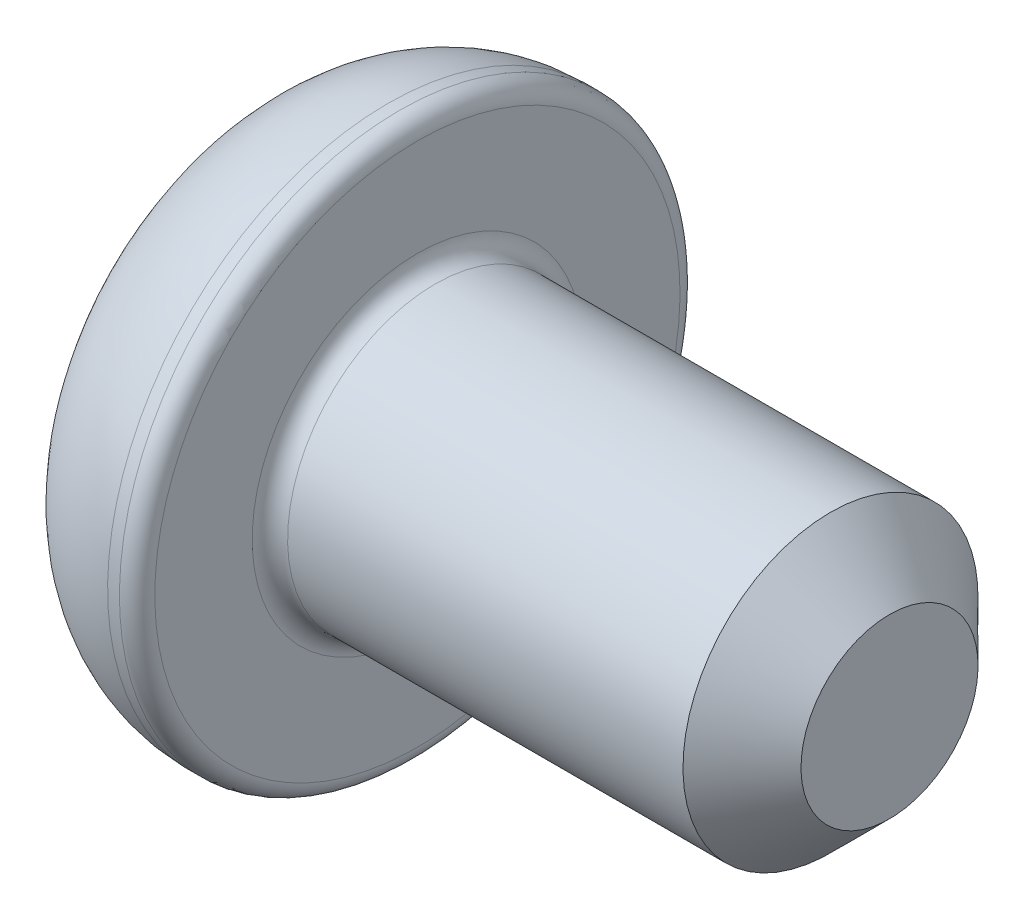
ISO-10303-21;
HEADER;
FILE_DESCRIPTION(('STEP AP214'),'2;1');
FILE_NAME('part.step','',(''),(''),'','','');
FILE_SCHEMA(('AUTOMOTIVE_DESIGN { 1 0 10303 214 1 1 1 1 }'));
ENDSEC;
DATA;
#1=APPLICATION_CONTEXT('core data for automotive mechanical design processes');
#2=APPLICATION_PROTOCOL_DEFINITION('international standard','automotive_design',2000,#1);
#3=PRODUCT_CONTEXT('',#1,'mechanical');
#4=PRODUCT('Part','Part','',(#3));
#5=PRODUCT_RELATED_PRODUCT_CATEGORY('part','',(#4));
#6=PRODUCT_DEFINITION_FORMATION('','',#4);
#7=PRODUCT_DEFINITION_CONTEXT('part definition',#1,'design');
#8=PRODUCT_DEFINITION('design','',#6,#7);
#9=PRODUCT_DEFINITION_SHAPE('','',#8);
#10=(LENGTH_UNIT() NAMED_UNIT(*) SI_UNIT(.MILLI.,.METRE.));
#11=(NAMED_UNIT(*) PLANE_ANGLE_UNIT() SI_UNIT($,.RADIAN.));
#12=(NAMED_UNIT(*) SI_UNIT($,.STERADIAN.) SOLID_ANGLE_UNIT());
#13=UNCERTAINTY_MEASURE_WITH_UNIT(LENGTH_MEASURE(1.E-05),#10,'distance_accuracy_value','');
#14=(GEOMETRIC_REPRESENTATION_CONTEXT(3) GLOBAL_UNCERTAINTY_ASSIGNED_CONTEXT((#13)) GLOBAL_UNIT_ASSIGNED_CONTEXT((#10,
#11,#12)) REPRESENTATION_CONTEXT('',''));
#15=CARTESIAN_POINT('',(0.,0.,0.));
#16=DIRECTION('',(0.,0.,1.));
#17=DIRECTION('',(1.,0.,0.));
#18=AXIS2_PLACEMENT_3D('',#15,#16,#17);
#19=CARTESIAN_POINT('',(0.,0.,0.));
#20=DIRECTION('',(-1.,0.,0.));
#21=DIRECTION('',(0.,-1.,0.));
#22=AXIS2_PLACEMENT_3D('',#19,#20,#21);
#23=PLANE('',#22);
#24=DIRECTION('',(0.,0.866025403784438,-0.5));
#25=VECTOR('',#24,1.);
#26=CARTESIAN_POINT('',(0.,0.,1.73205080756888));
#27=LINE('',#26,#25);
#28=CARTESIAN_POINT('',(0.,0.,1.73205080756888));
#29=VERTEX_POINT('',#28);
#30=CARTESIAN_POINT('',(0.,1.5,0.866025403784438));
#31=VERTEX_POINT('',#30);
#32=EDGE_CURVE('E53',#29,#31,#27,.T.);
#33=ORIENTED_EDGE('',*,*,#32,.F.);
#34=DIRECTION('',(0.,0.866025403784439,0.5));
#35=VECTOR('',#34,1.);
#36=CARTESIAN_POINT('',(0.,-1.5,0.866025403784438));
#37=LINE('',#36,#35);
#38=CARTESIAN_POINT('',(0.,-1.5,0.866025403784438));
#39=VERTEX_POINT('',#38);
#40=EDGE_CURVE('E136',#39,#29,#37,.T.);
#41=ORIENTED_EDGE('',*,*,#40,.F.);
#42=DIRECTION('',(0.,0.,1.));
#43=VECTOR('',#42,1.);
#44=CARTESIAN_POINT('',(0.,-1.5,-0.866025403784439));
#45=LINE('',#44,#43);
#46=CARTESIAN_POINT('',(0.,-1.5,-0.866025403784439));
#47=VERTEX_POINT('',#46);
#48=EDGE_CURVE('E134',#47,#39,#45,.T.);
#49=ORIENTED_EDGE('',*,*,#48,.F.);
#50=DIRECTION('',(0.,-0.866025403784438,0.5));
#51=VECTOR('',#50,1.);
#52=CARTESIAN_POINT('',(0.,0.,-1.73205080756888));
#53=LINE('',#52,#51);
#54=CARTESIAN_POINT('',(0.,0.,-1.73205080756888));
#55=VERTEX_POINT('',#54);
#56=EDGE_CURVE('E101',#55,#47,#53,.T.);
#57=ORIENTED_EDGE('',*,*,#56,.F.);
#58=DIRECTION('',(0.,-0.866025403784439,-0.5));
#59=VECTOR('',#58,1.);
#60=CARTESIAN_POINT('',(0.,1.5,-0.866025403784439));
#61=LINE('',#60,#59);
#62=CARTESIAN_POINT('',(0.,1.5,-0.866025403784439));
#63=VERTEX_POINT('',#62);
#64=EDGE_CURVE('E130',#63,#55,#61,.T.);
#65=ORIENTED_EDGE('',*,*,#64,.F.);
#66=DIRECTION('',(0.,0.,-1.));
#67=VECTOR('',#66,1.);
#68=CARTESIAN_POINT('',(0.,1.5,0.866025403784438));
#69=LINE('',#68,#67);
#70=EDGE_CURVE('E127',#31,#63,#69,.T.);
#71=ORIENTED_EDGE('',*,*,#70,.F.);
#72=EDGE_LOOP('',(#33,#41,#49,#57,#65,#71));
#73=FACE_BOUND('',#72,.T.);
#74=CARTESIAN_POINT('',(0.,0.,0.));
#75=DIRECTION('',(1.,0.,0.));
#76=DIRECTION('',(0.,1.,0.));
#77=AXIS2_PLACEMENT_3D('',#74,#75,#76);
#78=CIRCLE('',#77,3.625);
#79=CARTESIAN_POINT('',(0.,3.625,0.));
#80=VERTEX_POINT('',#79);
#81=EDGE_CURVE('E148',#80,#80,#78,.T.);
#82=ORIENTED_EDGE('',*,*,#81,.F.);
#83=EDGE_LOOP('',(#82));
#84=FACE_BOUND('',#83,.T.);
#85=ADVANCED_FACE('F37',(#73,#84),#23,.T.);
#86=CARTESIAN_POINT('',(2.1,0.,0.));
#87=DIRECTION('',(1.,0.,0.));
#88=DIRECTION('',(0.,1.,0.));
#89=AXIS2_PLACEMENT_3D('',#86,#87,#88);
#90=DEGENERATE_TOROIDAL_SURFACE('',#89,2.2275,2.5225,.T.);
#91=ORIENTED_EDGE('',*,*,#81,.T.);
#92=EDGE_LOOP('',(#91));
#93=FACE_BOUND('',#92,.T.);
#94=CARTESIAN_POINT('',(2.1,0.,0.));
#95=DIRECTION('',(1.,0.,0.));
#96=DIRECTION('',(0.,1.,0.));
#97=AXIS2_PLACEMENT_3D('',#94,#95,#96);
#98=CIRCLE('',#97,4.75);
#99=CARTESIAN_POINT('',(2.1,4.75,0.));
#100=VERTEX_POINT('',#99);
#101=EDGE_CURVE('E140',#100,#100,#98,.T.);
#102=ORIENTED_EDGE('',*,*,#101,.F.);
#103=EDGE_LOOP('',(#102));
#104=FACE_BOUND('',#103,.T.);
#105=ADVANCED_FACE('F177',(#93,#104),#90,.T.);
#106=CARTESIAN_POINT('',(10.6,0.,0.));
#107=DIRECTION('',(1.,0.,0.));
#108=DIRECTION('',(0.,1.,0.));
#109=AXIS2_PLACEMENT_3D('',#106,#107,#108);
#110=CYLINDRICAL_SURFACE('',#109,4.75);
#111=CARTESIAN_POINT('',(2.3,0.,0.));
#112=DIRECTION('',(1.,0.,0.));
#113=DIRECTION('',(0.,1.,0.));
#114=AXIS2_PLACEMENT_3D('',#111,#112,#113);
#115=CIRCLE('',#114,4.75);
#116=CARTESIAN_POINT('',(2.3,4.75,0.));
#117=VERTEX_POINT('',#116);
#118=EDGE_CURVE('E160',#117,#117,#115,.F.);
#119=ORIENTED_EDGE('',*,*,#118,.T.);
#120=EDGE_LOOP('',(#119));
#121=FACE_BOUND('',#120,.T.);
#122=ORIENTED_EDGE('',*,*,#101,.T.);
#123=EDGE_LOOP('',(#122));
#124=FACE_BOUND('',#123,.T.);
#125=ADVANCED_FACE('F183',(#121,#124),#110,.T.);
#126=CARTESIAN_POINT('',(2.6,4.75,0.));
#127=DIRECTION('',(1.,0.,0.));
#128=DIRECTION('',(0.,1.,0.));
#129=AXIS2_PLACEMENT_3D('',#126,#127,#128);
#130=PLANE('',#129);
#131=CARTESIAN_POINT('',(2.6,0.,0.));
#132=DIRECTION('',(1.,0.,0.));
#133=DIRECTION('',(0.,1.,0.));
#134=AXIS2_PLACEMENT_3D('',#131,#132,#133);
#135=CIRCLE('',#134,2.8);
#136=CARTESIAN_POINT('',(2.6,2.8,0.));
#137=VERTEX_POINT('',#136);
#138=EDGE_CURVE('E157',#137,#137,#135,.F.);
#139=ORIENTED_EDGE('',*,*,#138,.T.);
#140=EDGE_LOOP('',(#139));
#141=FACE_BOUND('',#140,.T.);
#142=CARTESIAN_POINT('',(2.6,0.,0.));
#143=DIRECTION('',(1.,0.,0.));
#144=DIRECTION('',(0.,1.,0.));
#145=AXIS2_PLACEMENT_3D('',#142,#143,#144);
#146=CIRCLE('',#145,4.45);
#147=CARTESIAN_POINT('',(2.6,4.45,0.));
#148=VERTEX_POINT('',#147);
#149=EDGE_CURVE('E154',#148,#148,#146,.T.);
#150=ORIENTED_EDGE('',*,*,#149,.T.);
#151=EDGE_LOOP('',(#150));
#152=FACE_BOUND('',#151,.T.);
#153=ADVANCED_FACE('F202',(#141,#152),#130,.T.);
#154=CARTESIAN_POINT('',(10.6,0.,0.));
#155=DIRECTION('',(1.,0.,0.));
#156=DIRECTION('',(0.,1.,0.));
#157=AXIS2_PLACEMENT_3D('',#154,#155,#156);
#158=CYLINDRICAL_SURFACE('',#157,2.5);
#159=CARTESIAN_POINT('',(9.6,0.,0.));
#160=DIRECTION('',(1.,0.,0.));
#161=DIRECTION('',(0.,1.,0.));
#162=AXIS2_PLACEMENT_3D('',#159,#160,#161);
#163=CIRCLE('',#162,2.5);
#164=CARTESIAN_POINT('',(9.6,2.5,0.));
#165=VERTEX_POINT('',#164);
#166=EDGE_CURVE('E11',#165,#165,#163,.F.);
#167=ORIENTED_EDGE('',*,*,#166,.T.);
#168=EDGE_LOOP('',(#167));
#169=FACE_BOUND('',#168,.T.);
#170=CARTESIAN_POINT('',(2.9,0.,0.));
#171=DIRECTION('',(1.,0.,0.));
#172=DIRECTION('',(0.,1.,0.));
#173=AXIS2_PLACEMENT_3D('',#170,#171,#172);
#174=CIRCLE('',#173,2.5);
#175=CARTESIAN_POINT('',(2.9,2.5,0.));
#176=VERTEX_POINT('',#175);
#177=EDGE_CURVE('E151',#176,#176,#174,.T.);
#178=ORIENTED_EDGE('',*,*,#177,.T.);
#179=EDGE_LOOP('',(#178));
#180=FACE_BOUND('',#179,.T.);
#181=ADVANCED_FACE('F200',(#169,#180),#158,.T.);
#182=CARTESIAN_POINT('',(10.6,2.5,0.));
#183=DIRECTION('',(1.,0.,0.));
#184=DIRECTION('',(0.,1.,0.));
#185=AXIS2_PLACEMENT_3D('',#182,#183,#184);
#186=PLANE('',#185);
#187=CARTESIAN_POINT('',(10.6,0.,0.));
#188=DIRECTION('',(1.,0.,0.));
#189=DIRECTION('',(0.,1.,0.));
#190=AXIS2_PLACEMENT_3D('',#187,#188,#189);
#191=CIRCLE('',#190,1.50000000000001);
#192=CARTESIAN_POINT('',(10.6,1.5,0.));
#193=VERTEX_POINT('',#192);
#194=EDGE_CURVE('E46',#193,#193,#191,.T.);
#195=ORIENTED_EDGE('',*,*,#194,.T.);
#196=EDGE_LOOP('',(#195));
#197=FACE_BOUND('',#196,.T.);
#198=ADVANCED_FACE('F165',(#197),#186,.T.);
#199=CARTESIAN_POINT('',(1.5,0.,1.73205080756888));
#200=DIRECTION('',(0.,0.5,0.866025403784439));
#201=DIRECTION('',(0.,-0.866025403784439,0.5));
#202=AXIS2_PLACEMENT_3D('',#199,#200,#201);
#203=PLANE('',#202);
#204=ORIENTED_EDGE('',*,*,#32,.T.);
#205=DIRECTION('',(-1.,0.,0.));
#206=VECTOR('',#205,1.);
#207=CARTESIAN_POINT('',(1.5,1.5,0.866025403784438));
#208=LINE('',#207,#206);
#209=CARTESIAN_POINT('',(1.5,1.5,0.866025403784438));
#210=VERTEX_POINT('',#209);
#211=EDGE_CURVE('E83',#210,#31,#208,.T.);
#212=ORIENTED_EDGE('',*,*,#211,.F.);
#213=DIRECTION('',(0.,0.866025403784438,-0.5));
#214=VECTOR('',#213,1.);
#215=CARTESIAN_POINT('',(1.5,0.,1.73205080756888));
#216=LINE('',#215,#214);
#217=CARTESIAN_POINT('',(1.5,0.,1.73205080756888));
#218=VERTEX_POINT('',#217);
#219=EDGE_CURVE('E138',#218,#210,#216,.T.);
#220=ORIENTED_EDGE('',*,*,#219,.F.);
#221=DIRECTION('',(-1.,0.,0.));
#222=VECTOR('',#221,1.);
#223=CARTESIAN_POINT('',(1.5,0.,1.73205080756888));
#224=LINE('',#223,#222);
#225=EDGE_CURVE('E61',#218,#29,#224,.T.);
#226=ORIENTED_EDGE('',*,*,#225,.T.);
#227=EDGE_LOOP('',(#204,#212,#220,#226));
#228=FACE_BOUND('',#227,.T.);
#229=ADVANCED_FACE('F209',(#228),#203,.F.);
#230=CARTESIAN_POINT('',(1.5,-1.5,0.866025403784438));
#231=DIRECTION('',(0.,-0.5,0.866025403784438));
#232=DIRECTION('',(0.,-0.866025403784439,-0.5));
#233=AXIS2_PLACEMENT_3D('',#230,#231,#232);
#234=PLANE('',#233);
#235=ORIENTED_EDGE('',*,*,#40,.T.);
#236=ORIENTED_EDGE('',*,*,#225,.F.);
#237=DIRECTION('',(0.,0.866025403784439,0.5));
#238=VECTOR('',#237,1.);
#239=CARTESIAN_POINT('',(1.5,-1.5,0.866025403784438));
#240=LINE('',#239,#238);
#241=CARTESIAN_POINT('',(1.5,-1.5,0.866025403784438));
#242=VERTEX_POINT('',#241);
#243=EDGE_CURVE('E113',#242,#218,#240,.T.);
#244=ORIENTED_EDGE('',*,*,#243,.F.);
#245=DIRECTION('',(-1.,0.,0.));
#246=VECTOR('',#245,1.);
#247=CARTESIAN_POINT('',(1.5,-1.5,0.866025403784438));
#248=LINE('',#247,#246);
#249=EDGE_CURVE('E105',#242,#39,#248,.T.);
#250=ORIENTED_EDGE('',*,*,#249,.T.);
#251=EDGE_LOOP('',(#235,#236,#244,#250));
#252=FACE_BOUND('',#251,.T.);
#253=ADVANCED_FACE('F266',(#252),#234,.F.);
#254=CARTESIAN_POINT('',(1.5,-1.5,-0.866025403784439));
#255=DIRECTION('',(0.,-1.,0.));
#256=DIRECTION('',(0.,0.,-1.));
#257=AXIS2_PLACEMENT_3D('',#254,#255,#256);
#258=PLANE('',#257);
#259=ORIENTED_EDGE('',*,*,#48,.T.);
#260=ORIENTED_EDGE('',*,*,#249,.F.);
#261=DIRECTION('',(0.,0.,1.));
#262=VECTOR('',#261,1.);
#263=CARTESIAN_POINT('',(1.5,-1.5,-0.866025403784439));
#264=LINE('',#263,#262);
#265=CARTESIAN_POINT('',(1.5,-1.5,-0.866025403784439));
#266=VERTEX_POINT('',#265);
#267=EDGE_CURVE('E109',#266,#242,#264,.T.);
#268=ORIENTED_EDGE('',*,*,#267,.F.);
#269=DIRECTION('',(-1.,0.,0.));
#270=VECTOR('',#269,1.);
#271=CARTESIAN_POINT('',(1.5,-1.5,-0.866025403784439));
#272=LINE('',#271,#270);
#273=EDGE_CURVE('E94',#266,#47,#272,.T.);
#274=ORIENTED_EDGE('',*,*,#273,.T.);
#275=EDGE_LOOP('',(#259,#260,#268,#274));
#276=FACE_BOUND('',#275,.T.);
#277=ADVANCED_FACE('F110',(#276),#258,.F.);
#278=CARTESIAN_POINT('',(1.5,0.,-1.73205080756888));
#279=DIRECTION('',(0.,-0.5,-0.866025403784439));
#280=DIRECTION('',(0.,0.866025403784439,-0.5));
#281=AXIS2_PLACEMENT_3D('',#278,#279,#280);
#282=PLANE('',#281);
#283=ORIENTED_EDGE('',*,*,#56,.T.);
#284=ORIENTED_EDGE('',*,*,#273,.F.);
#285=DIRECTION('',(0.,-0.866025403784438,0.5));
#286=VECTOR('',#285,1.);
#287=CARTESIAN_POINT('',(1.5,0.,-1.73205080756888));
#288=LINE('',#287,#286);
#289=CARTESIAN_POINT('',(1.5,0.,-1.73205080756888));
#290=VERTEX_POINT('',#289);
#291=EDGE_CURVE('E98',#290,#266,#288,.T.);
#292=ORIENTED_EDGE('',*,*,#291,.F.);
#293=DIRECTION('',(-1.,0.,0.));
#294=VECTOR('',#293,1.);
#295=CARTESIAN_POINT('',(1.5,0.,-1.73205080756888));
#296=LINE('',#295,#294);
#297=EDGE_CURVE('E106',#290,#55,#296,.T.);
#298=ORIENTED_EDGE('',*,*,#297,.T.);
#299=EDGE_LOOP('',(#283,#284,#292,#298));
#300=FACE_BOUND('',#299,.T.);
#301=ADVANCED_FACE('F96',(#300),#282,.F.);
#302=CARTESIAN_POINT('',(1.5,1.5,-0.866025403784439));
#303=DIRECTION('',(0.,0.5,-0.866025403784439));
#304=DIRECTION('',(0.,0.866025403784439,0.5));
#305=AXIS2_PLACEMENT_3D('',#302,#303,#304);
#306=PLANE('',#305);
#307=ORIENTED_EDGE('',*,*,#64,.T.);
#308=ORIENTED_EDGE('',*,*,#297,.F.);
#309=DIRECTION('',(0.,-0.866025403784439,-0.5));
#310=VECTOR('',#309,1.);
#311=CARTESIAN_POINT('',(1.5,1.5,-0.866025403784439));
#312=LINE('',#311,#310);
#313=CARTESIAN_POINT('',(1.5,1.5,-0.866025403784439));
#314=VERTEX_POINT('',#313);
#315=EDGE_CURVE('E119',#314,#290,#312,.T.);
#316=ORIENTED_EDGE('',*,*,#315,.F.);
#317=DIRECTION('',(-1.,0.,0.));
#318=VECTOR('',#317,1.);
#319=CARTESIAN_POINT('',(1.5,1.5,-0.866025403784439));
#320=LINE('',#319,#318);
#321=EDGE_CURVE('E143',#314,#63,#320,.T.);
#322=ORIENTED_EDGE('',*,*,#321,.T.);
#323=EDGE_LOOP('',(#307,#308,#316,#322));
#324=FACE_BOUND('',#323,.T.);
#325=ADVANCED_FACE('F283',(#324),#306,.F.);
#326=CARTESIAN_POINT('',(1.5,1.5,0.866025403784438));
#327=DIRECTION('',(0.,1.,0.));
#328=DIRECTION('',(0.,0.,1.));
#329=AXIS2_PLACEMENT_3D('',#326,#327,#328);
#330=PLANE('',#329);
#331=ORIENTED_EDGE('',*,*,#70,.T.);
#332=ORIENTED_EDGE('',*,*,#321,.F.);
#333=DIRECTION('',(0.,0.,-1.));
#334=VECTOR('',#333,1.);
#335=CARTESIAN_POINT('',(1.5,1.5,0.866025403784438));
#336=LINE('',#335,#334);
#337=EDGE_CURVE('E121',#210,#314,#336,.T.);
#338=ORIENTED_EDGE('',*,*,#337,.F.);
#339=ORIENTED_EDGE('',*,*,#211,.T.);
#340=EDGE_LOOP('',(#331,#332,#338,#339));
#341=FACE_BOUND('',#340,.T.);
#342=ADVANCED_FACE('F194',(#341),#330,.F.);
#343=CARTESIAN_POINT('',(1.5,0.,0.));
#344=DIRECTION('',(-1.,0.,0.));
#345=DIRECTION('',(0.,0.,1.));
#346=AXIS2_PLACEMENT_3D('',#343,#344,#345);
#347=PLANE('',#346);
#348=ORIENTED_EDGE('',*,*,#219,.T.);
#349=ORIENTED_EDGE('',*,*,#337,.T.);
#350=ORIENTED_EDGE('',*,*,#315,.T.);
#351=ORIENTED_EDGE('',*,*,#291,.T.);
#352=ORIENTED_EDGE('',*,*,#267,.T.);
#353=ORIENTED_EDGE('',*,*,#243,.T.);
#354=EDGE_LOOP('',(#348,#349,#350,#351,#352,#353));
#355=FACE_BOUND('',#354,.T.);
#356=ADVANCED_FACE('F116',(#355),#347,.T.);
#357=CARTESIAN_POINT('',(2.9,0.,0.));
#358=DIRECTION('',(1.,0.,0.));
#359=DIRECTION('',(0.,1.,0.));
#360=AXIS2_PLACEMENT_3D('',#357,#358,#359);
#361=TOROIDAL_SURFACE('',#360,2.8,0.3);
#362=ORIENTED_EDGE('',*,*,#138,.F.);
#363=EDGE_LOOP('',(#362));
#364=FACE_BOUND('',#363,.T.);
#365=ORIENTED_EDGE('',*,*,#177,.F.);
#366=EDGE_LOOP('',(#365));
#367=FACE_BOUND('',#366,.T.);
#368=ADVANCED_FACE('F173',(#364,#367),#361,.F.);
#369=CARTESIAN_POINT('',(2.3,0.,0.));
#370=DIRECTION('',(1.,0.,0.));
#371=DIRECTION('',(0.,1.,0.));
#372=AXIS2_PLACEMENT_3D('',#369,#370,#371);
#373=TOROIDAL_SURFACE('',#372,4.45,0.3);
#374=ORIENTED_EDGE('',*,*,#118,.F.);
#375=EDGE_LOOP('',(#374));
#376=FACE_BOUND('',#375,.T.);
#377=ORIENTED_EDGE('',*,*,#149,.F.);
#378=EDGE_LOOP('',(#377));
#379=FACE_BOUND('',#378,.T.);
#380=ADVANCED_FACE('F168',(#376,#379),#373,.T.);
#381=CARTESIAN_POINT('',(10.6,0.,0.));
#382=DIRECTION('',(-1.,0.,0.));
#383=DIRECTION('',(0.,-1.,0.));
#384=AXIS2_PLACEMENT_3D('',#381,#382,#383);
#385=CONICAL_SURFACE('',#384,1.5,0.785398163397446);
#386=ORIENTED_EDGE('',*,*,#166,.F.);
#387=EDGE_LOOP('',(#386));
#388=FACE_BOUND('',#387,.T.);
#389=ORIENTED_EDGE('',*,*,#194,.F.);
#390=EDGE_LOOP('',(#389));
#391=FACE_BOUND('',#390,.T.);
#392=ADVANCED_FACE('F40',(#388,#391),#385,.T.);
#393=CLOSED_SHELL('',(#85,#105,#125,#153,#181,#198,#229,#253,#277,#301,#325,#342,#356,#368,#380,#392));
#394=MANIFOLD_SOLID_BREP('B2',#393);
#395=ADVANCED_BREP_SHAPE_REPRESENTATION('',(#18,#394),#14);
#396=SHAPE_DEFINITION_REPRESENTATION(#9,#395);
ENDSEC;
END-ISO-10303-21;
